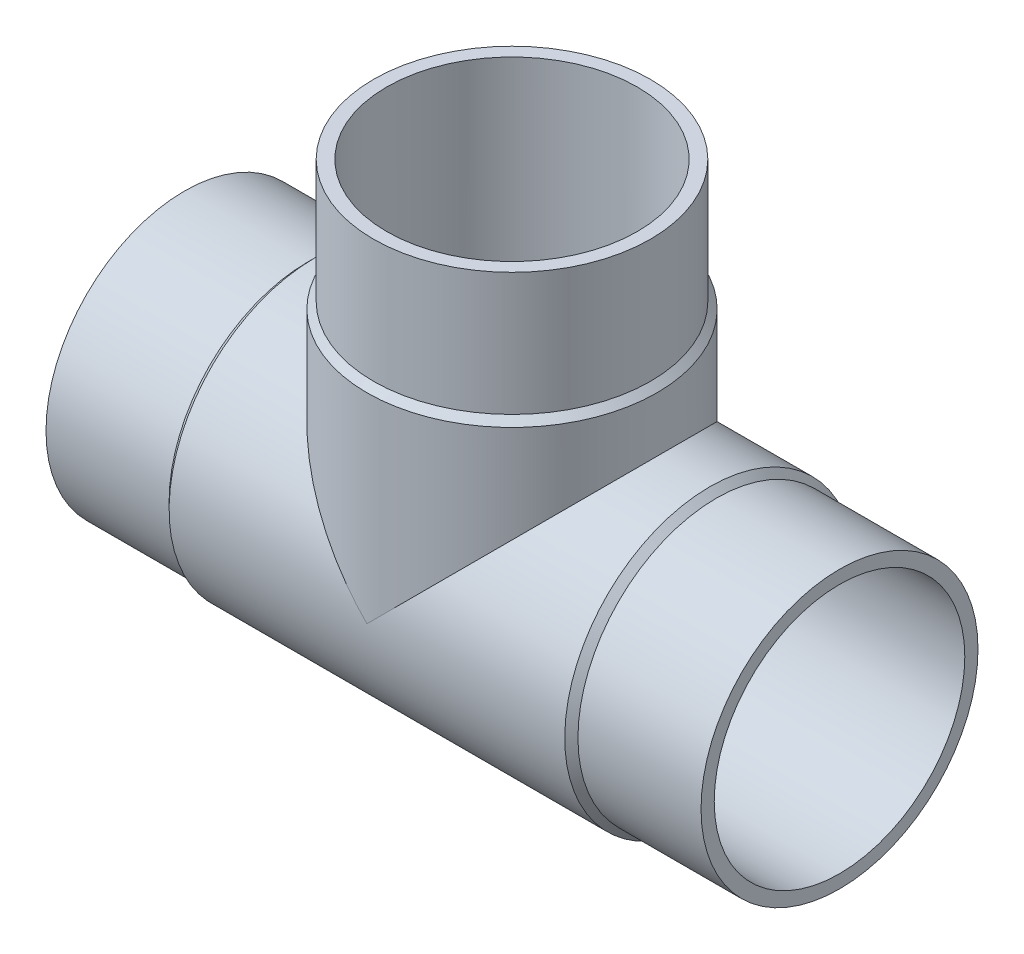
ISO-10303-21;
HEADER;
FILE_DESCRIPTION(('STEP AP214'),'2;1');
FILE_NAME('part.step','',(''),(''),'','','');
FILE_SCHEMA(('AUTOMOTIVE_DESIGN { 1 0 10303 214 1 1 1 1 }'));
ENDSEC;
DATA;
#1=APPLICATION_CONTEXT('core data for automotive mechanical design processes');
#2=APPLICATION_PROTOCOL_DEFINITION('international standard','automotive_design',2000,#1);
#3=PRODUCT_CONTEXT('',#1,'mechanical');
#4=PRODUCT('Part','Part','',(#3));
#5=PRODUCT_RELATED_PRODUCT_CATEGORY('part','',(#4));
#6=PRODUCT_DEFINITION_FORMATION('','',#4);
#7=PRODUCT_DEFINITION_CONTEXT('part definition',#1,'design');
#8=PRODUCT_DEFINITION('design','',#6,#7);
#9=PRODUCT_DEFINITION_SHAPE('','',#8);
#10=(LENGTH_UNIT() NAMED_UNIT(*) SI_UNIT(.MILLI.,.METRE.));
#11=(NAMED_UNIT(*) PLANE_ANGLE_UNIT() SI_UNIT($,.RADIAN.));
#12=(NAMED_UNIT(*) SI_UNIT($,.STERADIAN.) SOLID_ANGLE_UNIT());
#13=UNCERTAINTY_MEASURE_WITH_UNIT(LENGTH_MEASURE(1.E-05),#10,'distance_accuracy_value','');
#14=(GEOMETRIC_REPRESENTATION_CONTEXT(3) GLOBAL_UNCERTAINTY_ASSIGNED_CONTEXT((#13)) GLOBAL_UNIT_ASSIGNED_CONTEXT((#10,
#11,#12)) REPRESENTATION_CONTEXT('',''));
#15=CARTESIAN_POINT('',(0.,0.,0.));
#16=DIRECTION('',(0.,0.,1.));
#17=DIRECTION('',(1.,0.,0.));
#18=AXIS2_PLACEMENT_3D('',#15,#16,#17);
#19=CARTESIAN_POINT('',(-74.5,75.,0.));
#20=DIRECTION('',(0.,1.,0.));
#21=DIRECTION('',(0.,0.,1.));
#22=AXIS2_PLACEMENT_3D('',#19,#20,#21);
#23=CYLINDRICAL_SURFACE('',#22,31.5);
#24=CARTESIAN_POINT('',(-74.5,75.,0.));
#25=DIRECTION('',(0.,1.,0.));
#26=DIRECTION('',(0.,0.,1.));
#27=AXIS2_PLACEMENT_3D('',#24,#25,#26);
#28=CIRCLE('',#27,31.5);
#29=CARTESIAN_POINT('',(-74.5,75.,31.5));
#30=VERTEX_POINT('',#29);
#31=EDGE_CURVE('E18',#30,#30,#28,.T.);
#32=ORIENTED_EDGE('',*,*,#31,.F.);
#33=EDGE_LOOP('',(#32));
#34=FACE_BOUND('',#33,.T.);
#35=CARTESIAN_POINT('',(-74.5,47.,0.));
#36=DIRECTION('',(0.,1.,0.));
#37=DIRECTION('',(1.,0.,0.));
#38=AXIS2_PLACEMENT_3D('',#35,#36,#37);
#39=CIRCLE('',#38,31.5);
#40=CARTESIAN_POINT('',(-43.,47.,0.));
#41=VERTEX_POINT('',#40);
#42=EDGE_CURVE('E71',#41,#41,#39,.F.);
#43=ORIENTED_EDGE('',*,*,#42,.F.);
#44=EDGE_LOOP('',(#43));
#45=FACE_BOUND('',#44,.T.);
#46=ADVANCED_FACE('F15',(#34,#45),#23,.T.);
#47=CARTESIAN_POINT('',(-74.5,47.,0.));
#48=DIRECTION('',(0.,-1.,0.));
#49=DIRECTION('',(0.,0.,-1.));
#50=AXIS2_PLACEMENT_3D('',#47,#48,#49);
#51=CONICAL_SURFACE('',#50,31.5,0.785398163397448);
#52=CARTESIAN_POINT('',(-74.5,45.5000000000001,0.));
#53=DIRECTION('',(0.,1.,0.));
#54=DIRECTION('',(1.,0.,0.));
#55=AXIS2_PLACEMENT_3D('',#52,#53,#54);
#56=CIRCLE('',#55,33.);
#57=CARTESIAN_POINT('',(-41.5,45.5000000000001,0.));
#58=VERTEX_POINT('',#57);
#59=EDGE_CURVE('E60',#58,#58,#56,.F.);
#60=ORIENTED_EDGE('',*,*,#59,.F.);
#61=EDGE_LOOP('',(#60));
#62=FACE_BOUND('',#61,.T.);
#63=ORIENTED_EDGE('',*,*,#42,.T.);
#64=EDGE_LOOP('',(#63));
#65=FACE_BOUND('',#64,.T.);
#66=ADVANCED_FACE('F141',(#62,#65),#51,.T.);
#67=CARTESIAN_POINT('',(-28.,0.,0.));
#68=DIRECTION('',(-1.,0.,0.));
#69=DIRECTION('',(0.,0.,1.));
#70=AXIS2_PLACEMENT_3D('',#67,#68,#69);
#71=CYLINDRICAL_SURFACE('',#70,31.5);
#72=CARTESIAN_POINT('',(-28.,0.,0.));
#73=DIRECTION('',(1.,0.,0.));
#74=DIRECTION('',(0.,1.,0.));
#75=AXIS2_PLACEMENT_3D('',#72,#73,#74);
#76=CIRCLE('',#75,31.5);
#77=CARTESIAN_POINT('',(-28.,31.5,0.));
#78=VERTEX_POINT('',#77);
#79=EDGE_CURVE('E64',#78,#78,#76,.F.);
#80=ORIENTED_EDGE('',*,*,#79,.F.);
#81=EDGE_LOOP('',(#80));
#82=FACE_BOUND('',#81,.T.);
#83=CARTESIAN_POINT('',(0.,0.,0.));
#84=DIRECTION('',(-1.,0.,0.));
#85=DIRECTION('',(0.,0.,1.));
#86=AXIS2_PLACEMENT_3D('',#83,#84,#85);
#87=CIRCLE('',#86,31.5);
#88=CARTESIAN_POINT('',(0.,0.,31.5));
#89=VERTEX_POINT('',#88);
#90=EDGE_CURVE('E58',#89,#89,#87,.F.);
#91=ORIENTED_EDGE('',*,*,#90,.F.);
#92=EDGE_LOOP('',(#91));
#93=FACE_BOUND('',#92,.T.);
#94=ADVANCED_FACE('F136',(#82,#93),#71,.T.);
#95=CARTESIAN_POINT('',(-106.,75.,31.8780010542674));
#96=DIRECTION('',(0.,1.,0.));
#97=DIRECTION('',(1.,0.,0.));
#98=AXIS2_PLACEMENT_3D('',#95,#96,#97);
#99=PLANE('',#98);
#100=CARTESIAN_POINT('',(-74.5,75.,0.));
#101=DIRECTION('',(0.,1.,0.));
#102=DIRECTION('',(0.,0.,1.));
#103=AXIS2_PLACEMENT_3D('',#100,#101,#102);
#104=CIRCLE('',#103,28.5);
#105=CARTESIAN_POINT('',(-74.5,75.,28.5));
#106=VERTEX_POINT('',#105);
#107=EDGE_CURVE('E52',#106,#106,#104,.T.);
#108=ORIENTED_EDGE('',*,*,#107,.F.);
#109=EDGE_LOOP('',(#108));
#110=FACE_BOUND('',#109,.T.);
#111=ORIENTED_EDGE('',*,*,#31,.T.);
#112=EDGE_LOOP('',(#111));
#113=FACE_BOUND('',#112,.T.);
#114=ADVANCED_FACE('F130',(#110,#113),#99,.T.);
#115=CARTESIAN_POINT('',(-28.,0.,0.));
#116=DIRECTION('',(-1.,0.,0.));
#117=DIRECTION('',(0.,0.,1.));
#118=AXIS2_PLACEMENT_3D('',#115,#116,#117);
#119=CONICAL_SURFACE('',#118,31.5,0.785398163397459);
#120=ORIENTED_EDGE('',*,*,#79,.T.);
#121=EDGE_LOOP('',(#120));
#122=FACE_BOUND('',#121,.T.);
#123=CARTESIAN_POINT('',(-29.5,0.,0.));
#124=DIRECTION('',(-1.,0.,0.));
#125=DIRECTION('',(0.,1.,0.));
#126=AXIS2_PLACEMENT_3D('',#123,#124,#125);
#127=CIRCLE('',#126,33.);
#128=CARTESIAN_POINT('',(-29.5,33.,0.));
#129=VERTEX_POINT('',#128);
#130=EDGE_CURVE('E49',#129,#129,#127,.T.);
#131=ORIENTED_EDGE('',*,*,#130,.F.);
#132=EDGE_LOOP('',(#131));
#133=FACE_BOUND('',#132,.T.);
#134=ADVANCED_FACE('F95',(#122,#133),#119,.T.);
#135=CARTESIAN_POINT('',(-74.5,45.5000000000001,0.));
#136=DIRECTION('',(0.,1.,0.));
#137=DIRECTION('',(0.,0.,1.));
#138=AXIS2_PLACEMENT_3D('',#135,#136,#137);
#139=CYLINDRICAL_SURFACE('',#138,33.);
#140=CARTESIAN_POINT('',(-74.5,0.,0.));
#141=DIRECTION('',(0.707106781186547,0.707106781186547,0.));
#142=DIRECTION('',(-0.707106781186547,0.707106781186547,0.));
#143=AXIS2_PLACEMENT_3D('',#140,#141,#142);
#144=ELLIPSE('',#143,46.6690475583121,33.);
#145=CARTESIAN_POINT('',(-74.5,0.,33.));
#146=VERTEX_POINT('',#145);
#147=CARTESIAN_POINT('',(-74.5,0.,-33.));
#148=VERTEX_POINT('',#147);
#149=EDGE_CURVE('E44',#146,#148,#144,.F.);
#150=ORIENTED_EDGE('',*,*,#149,.F.);
#151=CARTESIAN_POINT('',(-74.5,0.,0.));
#152=DIRECTION('',(-0.707106781186547,0.707106781186547,0.));
#153=DIRECTION('',(-0.707106781186547,-0.707106781186547,0.));
#154=AXIS2_PLACEMENT_3D('',#151,#152,#153);
#155=ELLIPSE('',#154,46.6690475583121,33.);
#156=EDGE_CURVE('E40',#148,#146,#155,.F.);
#157=ORIENTED_EDGE('',*,*,#156,.F.);
#158=EDGE_LOOP('',(#150,#157));
#159=FACE_BOUND('',#158,.T.);
#160=ORIENTED_EDGE('',*,*,#59,.T.);
#161=EDGE_LOOP('',(#160));
#162=FACE_BOUND('',#161,.T.);
#163=ADVANCED_FACE('F47',(#159,#162),#139,.T.);
#164=CARTESIAN_POINT('',(0.,31.5,31.8780010540613));
#165=DIRECTION('',(1.,0.,0.));
#166=DIRECTION('',(0.,-1.,0.));
#167=AXIS2_PLACEMENT_3D('',#164,#165,#166);
#168=PLANE('',#167);
#169=CARTESIAN_POINT('',(0.,0.,0.));
#170=DIRECTION('',(-1.,0.,0.));
#171=DIRECTION('',(0.,0.,1.));
#172=AXIS2_PLACEMENT_3D('',#169,#170,#171);
#173=CIRCLE('',#172,28.5);
#174=CARTESIAN_POINT('',(0.,0.,28.5));
#175=VERTEX_POINT('',#174);
#176=EDGE_CURVE('E45',#175,#175,#173,.F.);
#177=ORIENTED_EDGE('',*,*,#176,.F.);
#178=EDGE_LOOP('',(#177));
#179=FACE_BOUND('',#178,.T.);
#180=ORIENTED_EDGE('',*,*,#90,.T.);
#181=EDGE_LOOP('',(#180));
#182=FACE_BOUND('',#181,.T.);
#183=ADVANCED_FACE('F85',(#179,#182),#168,.T.);
#184=CARTESIAN_POINT('',(-74.5,0.,0.));
#185=DIRECTION('',(0.,1.,0.));
#186=DIRECTION('',(0.,0.,1.));
#187=AXIS2_PLACEMENT_3D('',#184,#185,#186);
#188=CYLINDRICAL_SURFACE('',#187,28.5);
#189=CARTESIAN_POINT('',(-74.5,0.,0.));
#190=DIRECTION('',(-0.707106781186547,-0.707106781186547,0.));
#191=DIRECTION('',(-0.707106781186547,0.707106781186547,0.));
#192=AXIS2_PLACEMENT_3D('',#189,#190,#191);
#193=ELLIPSE('',#192,40.3050865276332,28.5);
#194=CARTESIAN_POINT('',(-74.5,0.,-28.5));
#195=VERTEX_POINT('',#194);
#196=CARTESIAN_POINT('',(-74.5,0.,28.5));
#197=VERTEX_POINT('',#196);
#198=EDGE_CURVE('E78',#195,#197,#193,.F.);
#199=ORIENTED_EDGE('',*,*,#198,.F.);
#200=CARTESIAN_POINT('',(-74.5,0.,0.));
#201=DIRECTION('',(-0.707106781186547,0.707106781186547,0.));
#202=DIRECTION('',(0.707106781186547,0.707106781186547,0.));
#203=AXIS2_PLACEMENT_3D('',#200,#201,#202);
#204=ELLIPSE('',#203,40.3050865276332,28.5);
#205=EDGE_CURVE('E32',#195,#197,#204,.F.);
#206=ORIENTED_EDGE('',*,*,#205,.T.);
#207=EDGE_LOOP('',(#199,#206));
#208=FACE_BOUND('',#207,.T.);
#209=ORIENTED_EDGE('',*,*,#107,.T.);
#210=EDGE_LOOP('',(#209));
#211=FACE_BOUND('',#210,.T.);
#212=ADVANCED_FACE('F87',(#208,#211),#188,.F.);
#213=CARTESIAN_POINT('',(-119.5,0.,0.));
#214=DIRECTION('',(-1.,0.,0.));
#215=DIRECTION('',(0.,0.,1.));
#216=AXIS2_PLACEMENT_3D('',#213,#214,#215);
#217=CYLINDRICAL_SURFACE('',#216,33.);
#218=ORIENTED_EDGE('',*,*,#130,.T.);
#219=EDGE_LOOP('',(#218));
#220=FACE_BOUND('',#219,.T.);
#221=CARTESIAN_POINT('',(-119.5,0.,0.));
#222=DIRECTION('',(-1.,0.,0.));
#223=DIRECTION('',(0.,1.,0.));
#224=AXIS2_PLACEMENT_3D('',#221,#222,#223);
#225=CIRCLE('',#224,33.);
#226=CARTESIAN_POINT('',(-119.5,33.,0.));
#227=VERTEX_POINT('',#226);
#228=EDGE_CURVE('E77',#227,#227,#225,.T.);
#229=ORIENTED_EDGE('',*,*,#228,.F.);
#230=EDGE_LOOP('',(#229));
#231=FACE_BOUND('',#230,.T.);
#232=ORIENTED_EDGE('',*,*,#149,.T.);
#233=ORIENTED_EDGE('',*,*,#156,.T.);
#234=EDGE_LOOP('',(#232,#233));
#235=FACE_BOUND('',#234,.T.);
#236=ADVANCED_FACE('F43',(#220,#231,#235),#217,.T.);
#237=CARTESIAN_POINT('',(-74.5,0.,0.));
#238=DIRECTION('',(-1.,0.,0.));
#239=DIRECTION('',(0.,0.,1.));
#240=AXIS2_PLACEMENT_3D('',#237,#238,#239);
#241=CYLINDRICAL_SURFACE('',#240,28.5);
#242=ORIENTED_EDGE('',*,*,#205,.F.);
#243=ORIENTED_EDGE('',*,*,#198,.T.);
#244=EDGE_LOOP('',(#242,#243));
#245=FACE_BOUND('',#244,.T.);
#246=ORIENTED_EDGE('',*,*,#176,.T.);
#247=EDGE_LOOP('',(#246));
#248=FACE_BOUND('',#247,.T.);
#249=CARTESIAN_POINT('',(-149.,0.,0.));
#250=DIRECTION('',(-1.,0.,0.));
#251=DIRECTION('',(0.,0.,1.));
#252=AXIS2_PLACEMENT_3D('',#249,#250,#251);
#253=CIRCLE('',#252,28.5);
#254=CARTESIAN_POINT('',(-149.,0.,28.5));
#255=VERTEX_POINT('',#254);
#256=EDGE_CURVE('E74',#255,#255,#253,.F.);
#257=ORIENTED_EDGE('',*,*,#256,.F.);
#258=EDGE_LOOP('',(#257));
#259=FACE_BOUND('',#258,.T.);
#260=ADVANCED_FACE('F82',(#245,#248,#259),#241,.F.);
#261=CARTESIAN_POINT('',(-121.,0.,0.));
#262=DIRECTION('',(1.,0.,0.));
#263=DIRECTION('',(0.,0.,-1.));
#264=AXIS2_PLACEMENT_3D('',#261,#262,#263);
#265=CONICAL_SURFACE('',#264,31.5,0.785398163397458);
#266=ORIENTED_EDGE('',*,*,#228,.T.);
#267=EDGE_LOOP('',(#266));
#268=FACE_BOUND('',#267,.T.);
#269=CARTESIAN_POINT('',(-121.,0.,0.));
#270=DIRECTION('',(-1.,0.,0.));
#271=DIRECTION('',(0.,1.,0.));
#272=AXIS2_PLACEMENT_3D('',#269,#270,#271);
#273=CIRCLE('',#272,31.5);
#274=CARTESIAN_POINT('',(-121.,31.5,0.));
#275=VERTEX_POINT('',#274);
#276=EDGE_CURVE('E24',#275,#275,#273,.T.);
#277=ORIENTED_EDGE('',*,*,#276,.F.);
#278=EDGE_LOOP('',(#277));
#279=FACE_BOUND('',#278,.T.);
#280=ADVANCED_FACE('F105',(#268,#279),#265,.T.);
#281=CARTESIAN_POINT('',(-149.,-31.5,31.8780010542674));
#282=DIRECTION('',(-1.,0.,0.));
#283=DIRECTION('',(0.,1.,0.));
#284=AXIS2_PLACEMENT_3D('',#281,#282,#283);
#285=PLANE('',#284);
#286=ORIENTED_EDGE('',*,*,#256,.T.);
#287=EDGE_LOOP('',(#286));
#288=FACE_BOUND('',#287,.T.);
#289=CARTESIAN_POINT('',(-149.,0.,0.));
#290=DIRECTION('',(-1.,0.,0.));
#291=DIRECTION('',(0.,0.,1.));
#292=AXIS2_PLACEMENT_3D('',#289,#290,#291);
#293=CIRCLE('',#292,31.5);
#294=CARTESIAN_POINT('',(-149.,0.,31.5));
#295=VERTEX_POINT('',#294);
#296=EDGE_CURVE('E9',#295,#295,#293,.F.);
#297=ORIENTED_EDGE('',*,*,#296,.F.);
#298=EDGE_LOOP('',(#297));
#299=FACE_BOUND('',#298,.T.);
#300=ADVANCED_FACE('F99',(#288,#299),#285,.T.);
#301=CARTESIAN_POINT('',(-149.,0.,0.));
#302=DIRECTION('',(-1.,0.,0.));
#303=DIRECTION('',(0.,0.,1.));
#304=AXIS2_PLACEMENT_3D('',#301,#302,#303);
#305=CYLINDRICAL_SURFACE('',#304,31.5);
#306=ORIENTED_EDGE('',*,*,#276,.T.);
#307=EDGE_LOOP('',(#306));
#308=FACE_BOUND('',#307,.T.);
#309=ORIENTED_EDGE('',*,*,#296,.T.);
#310=EDGE_LOOP('',(#309));
#311=FACE_BOUND('',#310,.T.);
#312=ADVANCED_FACE('F97',(#308,#311),#305,.T.);
#313=CLOSED_SHELL('',(#46,#66,#94,#114,#134,#163,#183,#212,#236,#260,#280,#300,#312));
#314=MANIFOLD_SOLID_BREP('B1',#313);
#315=ADVANCED_BREP_SHAPE_REPRESENTATION('',(#18,#314),#14);
#316=SHAPE_DEFINITION_REPRESENTATION(#9,#315);
ENDSEC;
END-ISO-10303-21;
